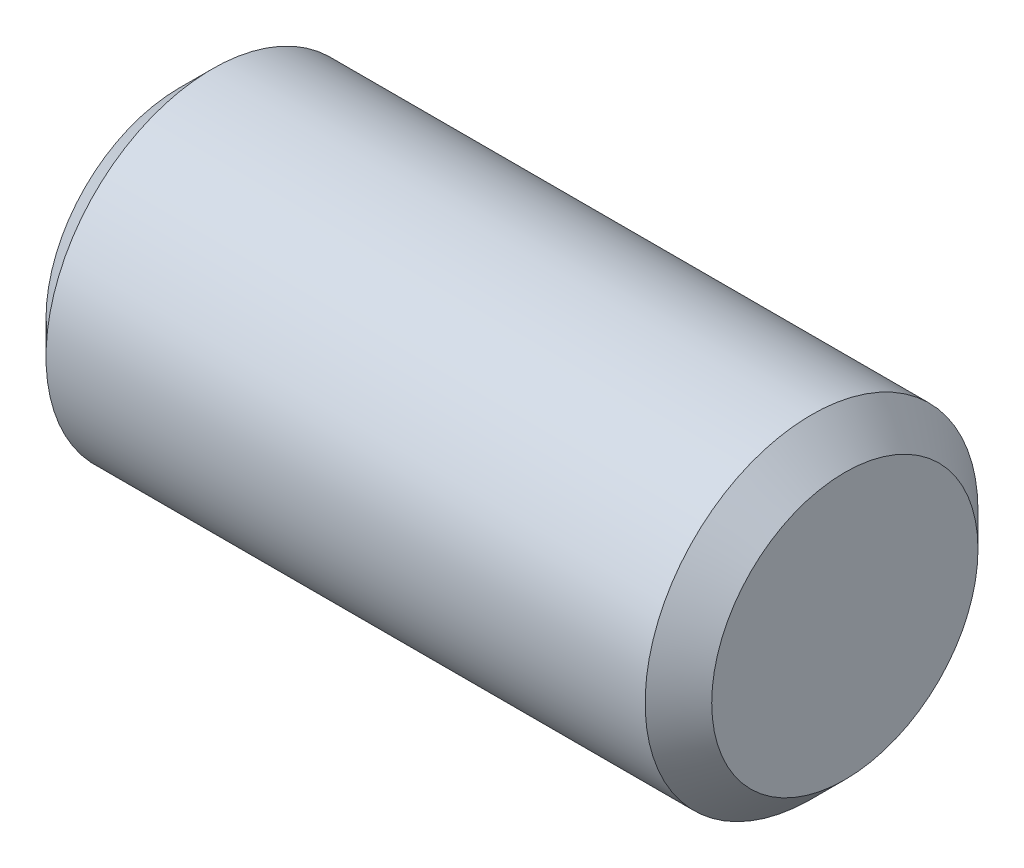
ISO-10303-21;
HEADER;
FILE_DESCRIPTION(('STEP AP214'),'2;1');
FILE_NAME('part.step','',(''),(''),'','','');
FILE_SCHEMA(('AUTOMOTIVE_DESIGN { 1 0 10303 214 1 1 1 1 }'));
ENDSEC;
DATA;
#1=APPLICATION_CONTEXT('core data for automotive mechanical design processes');
#2=APPLICATION_PROTOCOL_DEFINITION('international standard','automotive_design',2000,#1);
#3=PRODUCT_CONTEXT('',#1,'mechanical');
#4=PRODUCT('Part','Part','',(#3));
#5=PRODUCT_RELATED_PRODUCT_CATEGORY('part','',(#4));
#6=PRODUCT_DEFINITION_FORMATION('','',#4);
#7=PRODUCT_DEFINITION_CONTEXT('part definition',#1,'design');
#8=PRODUCT_DEFINITION('design','',#6,#7);
#9=PRODUCT_DEFINITION_SHAPE('','',#8);
#10=(LENGTH_UNIT() NAMED_UNIT(*) SI_UNIT(.MILLI.,.METRE.));
#11=(NAMED_UNIT(*) PLANE_ANGLE_UNIT() SI_UNIT($,.RADIAN.));
#12=(NAMED_UNIT(*) SI_UNIT($,.STERADIAN.) SOLID_ANGLE_UNIT());
#13=UNCERTAINTY_MEASURE_WITH_UNIT(LENGTH_MEASURE(1.E-05),#10,'distance_accuracy_value','');
#14=(GEOMETRIC_REPRESENTATION_CONTEXT(3) GLOBAL_UNCERTAINTY_ASSIGNED_CONTEXT((#13)) GLOBAL_UNIT_ASSIGNED_CONTEXT((#10,
#11,#12)) REPRESENTATION_CONTEXT('',''));
#15=CARTESIAN_POINT('',(0.,0.,0.));
#16=DIRECTION('',(0.,0.,1.));
#17=DIRECTION('',(1.,0.,0.));
#18=AXIS2_PLACEMENT_3D('',#15,#16,#17);
#19=CARTESIAN_POINT('',(-6.35,0.,0.));
#20=DIRECTION('',(1.,0.,0.));
#21=DIRECTION('',(0.,0.,-1.));
#22=AXIS2_PLACEMENT_3D('',#19,#20,#21);
#23=CYLINDRICAL_SURFACE('',#22,3.175);
#24=CARTESIAN_POINT('',(5.715,0.,0.));
#25=DIRECTION('',(1.,0.,0.));
#26=DIRECTION('',(0.,0.,-1.));
#27=AXIS2_PLACEMENT_3D('',#24,#25,#26);
#28=CIRCLE('',#27,3.175);
#29=CARTESIAN_POINT('',(5.715,0.,-3.175));
#30=VERTEX_POINT('',#29);
#31=EDGE_CURVE('E37',#30,#30,#28,.F.);
#32=ORIENTED_EDGE('',*,*,#31,.T.);
#33=EDGE_LOOP('',(#32));
#34=FACE_BOUND('',#33,.T.);
#35=CARTESIAN_POINT('',(-5.715,0.,0.));
#36=DIRECTION('',(1.,0.,0.));
#37=DIRECTION('',(0.,0.,-1.));
#38=AXIS2_PLACEMENT_3D('',#35,#36,#37);
#39=CIRCLE('',#38,3.175);
#40=CARTESIAN_POINT('',(-5.715,0.,-3.175));
#41=VERTEX_POINT('',#40);
#42=EDGE_CURVE('E41',#41,#41,#39,.T.);
#43=ORIENTED_EDGE('',*,*,#42,.T.);
#44=EDGE_LOOP('',(#43));
#45=FACE_BOUND('',#44,.T.);
#46=ADVANCED_FACE('F30',(#34,#45),#23,.T.);
#47=CARTESIAN_POINT('',(-6.35,0.,0.));
#48=DIRECTION('',(1.,0.,0.));
#49=DIRECTION('',(0.,0.,-1.));
#50=AXIS2_PLACEMENT_3D('',#47,#48,#49);
#51=PLANE('',#50);
#52=CARTESIAN_POINT('',(-6.35,0.,0.));
#53=DIRECTION('',(1.,0.,0.));
#54=DIRECTION('',(0.,0.,-1.));
#55=AXIS2_PLACEMENT_3D('',#52,#53,#54);
#56=CIRCLE('',#55,2.54);
#57=CARTESIAN_POINT('',(-6.35,0.,-2.54));
#58=VERTEX_POINT('',#57);
#59=EDGE_CURVE('E10',#58,#58,#56,.F.);
#60=ORIENTED_EDGE('',*,*,#59,.T.);
#61=EDGE_LOOP('',(#60));
#62=FACE_BOUND('',#61,.T.);
#63=ADVANCED_FACE('F61',(#62),#51,.F.);
#64=CARTESIAN_POINT('',(6.35,0.,0.));
#65=DIRECTION('',(1.,0.,0.));
#66=DIRECTION('',(0.,0.,-1.));
#67=AXIS2_PLACEMENT_3D('',#64,#65,#66);
#68=PLANE('',#67);
#69=CARTESIAN_POINT('',(6.35,0.,0.));
#70=DIRECTION('',(1.,0.,0.));
#71=DIRECTION('',(0.,0.,-1.));
#72=AXIS2_PLACEMENT_3D('',#69,#70,#71);
#73=CIRCLE('',#72,2.54);
#74=CARTESIAN_POINT('',(6.35,0.,-2.54));
#75=VERTEX_POINT('',#74);
#76=EDGE_CURVE('E45',#75,#75,#73,.T.);
#77=ORIENTED_EDGE('',*,*,#76,.T.);
#78=EDGE_LOOP('',(#77));
#79=FACE_BOUND('',#78,.T.);
#80=ADVANCED_FACE('F51',(#79),#68,.T.);
#81=CARTESIAN_POINT('',(6.35,0.,0.));
#82=DIRECTION('',(-1.,0.,0.));
#83=DIRECTION('',(0.,0.,1.));
#84=AXIS2_PLACEMENT_3D('',#81,#82,#83);
#85=CONICAL_SURFACE('',#84,2.54,0.785398163397448);
#86=ORIENTED_EDGE('',*,*,#31,.F.);
#87=EDGE_LOOP('',(#86));
#88=FACE_BOUND('',#87,.T.);
#89=ORIENTED_EDGE('',*,*,#76,.F.);
#90=EDGE_LOOP('',(#89));
#91=FACE_BOUND('',#90,.T.);
#92=ADVANCED_FACE('F53',(#88,#91),#85,.T.);
#93=CARTESIAN_POINT('',(-5.715,0.,0.));
#94=DIRECTION('',(1.,0.,0.));
#95=DIRECTION('',(0.,0.,-1.));
#96=AXIS2_PLACEMENT_3D('',#93,#94,#95);
#97=CONICAL_SURFACE('',#96,3.175,0.78539816339745);
#98=ORIENTED_EDGE('',*,*,#59,.F.);
#99=EDGE_LOOP('',(#98));
#100=FACE_BOUND('',#99,.T.);
#101=ORIENTED_EDGE('',*,*,#42,.F.);
#102=EDGE_LOOP('',(#101));
#103=FACE_BOUND('',#102,.T.);
#104=ADVANCED_FACE('F32',(#100,#103),#97,.T.);
#105=CLOSED_SHELL('',(#46,#63,#80,#92,#104));
#106=MANIFOLD_SOLID_BREP('B2',#105);
#107=ADVANCED_BREP_SHAPE_REPRESENTATION('',(#18,#106),#14);
#108=SHAPE_DEFINITION_REPRESENTATION(#9,#107);
ENDSEC;
END-ISO-10303-21;
